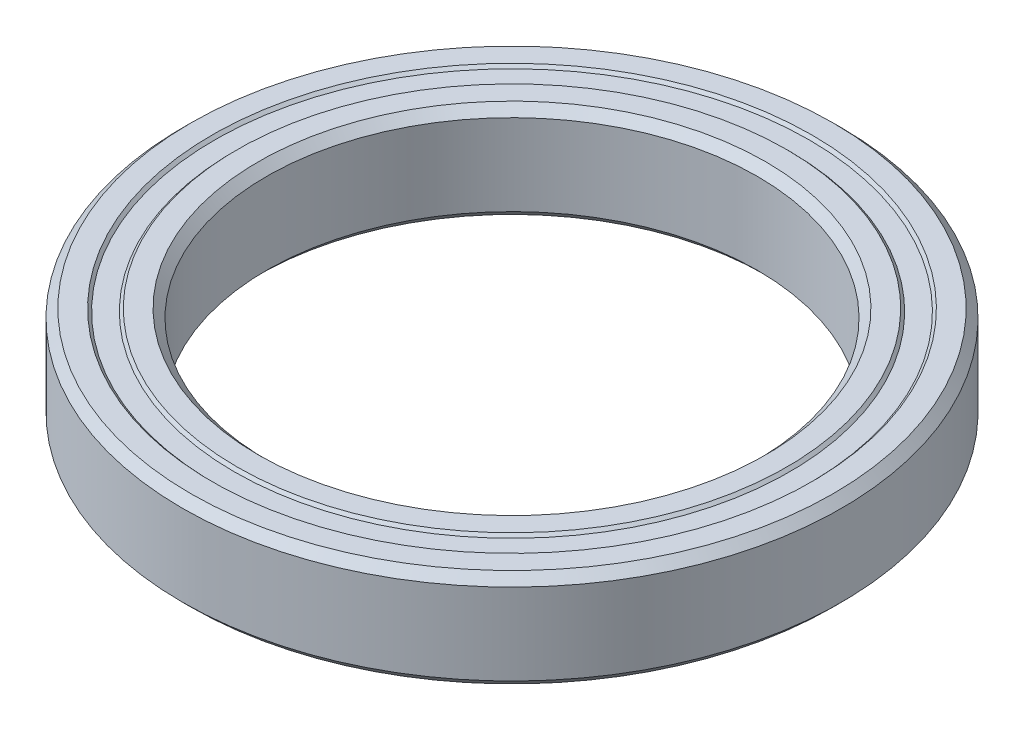
ISO-10303-21;
HEADER;
FILE_DESCRIPTION(('STEP AP214'),'2;1');
FILE_NAME('part.step','',(''),(''),'','','');
FILE_SCHEMA(('AUTOMOTIVE_DESIGN { 1 0 10303 214 1 1 1 1 }'));
ENDSEC;
DATA;
#1=APPLICATION_CONTEXT('core data for automotive mechanical design processes');
#2=APPLICATION_PROTOCOL_DEFINITION('international standard','automotive_design',2000,#1);
#3=PRODUCT_CONTEXT('',#1,'mechanical');
#4=PRODUCT('Part','Part','',(#3));
#5=PRODUCT_RELATED_PRODUCT_CATEGORY('part','',(#4));
#6=PRODUCT_DEFINITION_FORMATION('','',#4);
#7=PRODUCT_DEFINITION_CONTEXT('part definition',#1,'design');
#8=PRODUCT_DEFINITION('design','',#6,#7);
#9=PRODUCT_DEFINITION_SHAPE('','',#8);
#10=(LENGTH_UNIT() NAMED_UNIT(*) SI_UNIT(.MILLI.,.METRE.));
#11=(NAMED_UNIT(*) PLANE_ANGLE_UNIT() SI_UNIT($,.RADIAN.));
#12=(NAMED_UNIT(*) SI_UNIT($,.STERADIAN.) SOLID_ANGLE_UNIT());
#13=UNCERTAINTY_MEASURE_WITH_UNIT(LENGTH_MEASURE(1.E-05),#10,'distance_accuracy_value','');
#14=(GEOMETRIC_REPRESENTATION_CONTEXT(3) GLOBAL_UNCERTAINTY_ASSIGNED_CONTEXT((#13)) GLOBAL_UNIT_ASSIGNED_CONTEXT((#10,
#11,#12)) REPRESENTATION_CONTEXT('',''));
#15=CARTESIAN_POINT('',(0.,0.,0.));
#16=DIRECTION('',(0.,0.,1.));
#17=DIRECTION('',(1.,0.,0.));
#18=AXIS2_PLACEMENT_3D('',#15,#16,#17);
#19=CARTESIAN_POINT('',(0.,3.49999999999999,0.));
#20=DIRECTION('',(0.,1.,0.));
#21=DIRECTION('',(0.,0.,1.));
#22=AXIS2_PLACEMENT_3D('',#19,#20,#21);
#23=CONICAL_SURFACE('',#22,18.1,0.785398163397469);
#24=CARTESIAN_POINT('',(0.,2.90000000000002,0.));
#25=DIRECTION('',(0.,-1.,0.));
#26=DIRECTION('',(0.,0.,-1.));
#27=AXIS2_PLACEMENT_3D('',#24,#25,#26);
#28=CIRCLE('',#27,17.5);
#29=CARTESIAN_POINT('',(0.,2.90000000000002,-17.5));
#30=VERTEX_POINT('',#29);
#31=EDGE_CURVE('E10',#30,#30,#28,.T.);
#32=ORIENTED_EDGE('',*,*,#31,.T.);
#33=EDGE_LOOP('',(#32));
#34=FACE_BOUND('',#33,.T.);
#35=CARTESIAN_POINT('',(0.,3.49999999999999,0.));
#36=DIRECTION('',(0.,-1.,0.));
#37=DIRECTION('',(0.,0.,-1.));
#38=AXIS2_PLACEMENT_3D('',#35,#36,#37);
#39=CIRCLE('',#38,18.1);
#40=CARTESIAN_POINT('',(0.,3.49999999999999,-18.1));
#41=VERTEX_POINT('',#40);
#42=EDGE_CURVE('E88',#41,#41,#39,.T.);
#43=ORIENTED_EDGE('',*,*,#42,.F.);
#44=EDGE_LOOP('',(#43));
#45=FACE_BOUND('',#44,.T.);
#46=ADVANCED_FACE('F36',(#34,#45),#23,.F.);
#47=CARTESIAN_POINT('',(0.,-1.34942197217015,0.));
#48=DIRECTION('',(0.,-1.,0.));
#49=DIRECTION('',(0.,0.,-1.));
#50=AXIS2_PLACEMENT_3D('',#47,#48,#49);
#51=CYLINDRICAL_SURFACE('',#50,17.5);
#52=CARTESIAN_POINT('',(0.,-2.90000000000002,0.));
#53=DIRECTION('',(0.,-1.,0.));
#54=DIRECTION('',(0.,0.,-1.));
#55=AXIS2_PLACEMENT_3D('',#52,#53,#54);
#56=CIRCLE('',#55,17.5);
#57=CARTESIAN_POINT('',(0.,-2.90000000000002,-17.5));
#58=VERTEX_POINT('',#57);
#59=EDGE_CURVE('E42',#58,#58,#56,.T.);
#60=ORIENTED_EDGE('',*,*,#59,.T.);
#61=EDGE_LOOP('',(#60));
#62=FACE_BOUND('',#61,.T.);
#63=ORIENTED_EDGE('',*,*,#31,.F.);
#64=EDGE_LOOP('',(#63));
#65=FACE_BOUND('',#64,.T.);
#66=ADVANCED_FACE('F96',(#62,#65),#51,.F.);
#67=CARTESIAN_POINT('',(0.,-2.90000000000002,0.));
#68=DIRECTION('',(0.,-1.,0.));
#69=DIRECTION('',(0.,0.,-1.));
#70=AXIS2_PLACEMENT_3D('',#67,#68,#69);
#71=CONICAL_SURFACE('',#70,17.5,0.785398163397434);
#72=CARTESIAN_POINT('',(0.,-3.50000000000001,0.));
#73=DIRECTION('',(0.,-1.,0.));
#74=DIRECTION('',(0.,0.,-1.));
#75=AXIS2_PLACEMENT_3D('',#72,#73,#74);
#76=CIRCLE('',#75,18.1);
#77=CARTESIAN_POINT('',(0.,-3.50000000000001,-18.1));
#78=VERTEX_POINT('',#77);
#79=EDGE_CURVE('E46',#78,#78,#76,.T.);
#80=ORIENTED_EDGE('',*,*,#79,.T.);
#81=EDGE_LOOP('',(#80));
#82=FACE_BOUND('',#81,.T.);
#83=ORIENTED_EDGE('',*,*,#59,.F.);
#84=EDGE_LOOP('',(#83));
#85=FACE_BOUND('',#84,.T.);
#86=ADVANCED_FACE('F100',(#82,#85),#71,.F.);
#87=CARTESIAN_POINT('',(18.1,-3.50000000000001,0.));
#88=DIRECTION('',(0.,-1.,0.));
#89=DIRECTION('',(0.,0.,-1.));
#90=AXIS2_PLACEMENT_3D('',#87,#88,#89);
#91=PLANE('',#90);
#92=CARTESIAN_POINT('',(0.,-3.50000000000001,0.));
#93=DIRECTION('',(0.,-1.,0.));
#94=DIRECTION('',(0.,0.,-1.));
#95=AXIS2_PLACEMENT_3D('',#92,#93,#94);
#96=CIRCLE('',#95,19.6);
#97=CARTESIAN_POINT('',(0.,-3.50000000000001,-19.6));
#98=VERTEX_POINT('',#97);
#99=EDGE_CURVE('E50',#98,#98,#96,.T.);
#100=ORIENTED_EDGE('',*,*,#99,.T.);
#101=EDGE_LOOP('',(#100));
#102=FACE_BOUND('',#101,.T.);
#103=ORIENTED_EDGE('',*,*,#79,.F.);
#104=EDGE_LOOP('',(#103));
#105=FACE_BOUND('',#104,.T.);
#106=ADVANCED_FACE('F104',(#102,#105),#91,.T.);
#107=CARTESIAN_POINT('',(0.,-3.50000000000001,0.));
#108=DIRECTION('',(0.,1.,0.));
#109=DIRECTION('',(0.,0.,1.));
#110=AXIS2_PLACEMENT_3D('',#107,#108,#109);
#111=CONICAL_SURFACE('',#110,19.6,0.785398163397404);
#112=CARTESIAN_POINT('',(0.,-3.3,0.));
#113=DIRECTION('',(0.,-1.,0.));
#114=DIRECTION('',(0.,0.,-1.));
#115=AXIS2_PLACEMENT_3D('',#112,#113,#114);
#116=CIRCLE('',#115,19.8);
#117=CARTESIAN_POINT('',(0.,-3.3,-19.8));
#118=VERTEX_POINT('',#117);
#119=EDGE_CURVE('E55',#118,#118,#116,.T.);
#120=ORIENTED_EDGE('',*,*,#119,.T.);
#121=EDGE_LOOP('',(#120));
#122=FACE_BOUND('',#121,.T.);
#123=ORIENTED_EDGE('',*,*,#99,.F.);
#124=EDGE_LOOP('',(#123));
#125=FACE_BOUND('',#124,.T.);
#126=ADVANCED_FACE('F111',(#122,#125),#111,.T.);
#127=CARTESIAN_POINT('',(19.8,-3.3,0.));
#128=DIRECTION('',(0.,-1.,0.));
#129=DIRECTION('',(0.,0.,-1.));
#130=AXIS2_PLACEMENT_3D('',#127,#128,#129);
#131=PLANE('',#130);
#132=CARTESIAN_POINT('',(0.,-3.3,0.));
#133=DIRECTION('',(0.,-1.,0.));
#134=DIRECTION('',(0.,0.,-1.));
#135=AXIS2_PLACEMENT_3D('',#132,#133,#134);
#136=CIRCLE('',#135,21.2);
#137=CARTESIAN_POINT('',(0.,-3.3,-21.2));
#138=VERTEX_POINT('',#137);
#139=EDGE_CURVE('E58',#138,#138,#136,.T.);
#140=ORIENTED_EDGE('',*,*,#139,.T.);
#141=EDGE_LOOP('',(#140));
#142=FACE_BOUND('',#141,.T.);
#143=ORIENTED_EDGE('',*,*,#119,.F.);
#144=EDGE_LOOP('',(#143));
#145=FACE_BOUND('',#144,.T.);
#146=ADVANCED_FACE('F115',(#142,#145),#131,.T.);
#147=CARTESIAN_POINT('',(0.,-3.3,0.));
#148=DIRECTION('',(0.,-1.,0.));
#149=DIRECTION('',(0.,0.,-1.));
#150=AXIS2_PLACEMENT_3D('',#147,#148,#149);
#151=CONICAL_SURFACE('',#150,21.2,0.785398163397396);
#152=CARTESIAN_POINT('',(0.,-3.50000000000001,0.));
#153=DIRECTION('',(0.,-1.,0.));
#154=DIRECTION('',(0.,0.,-1.));
#155=AXIS2_PLACEMENT_3D('',#152,#153,#154);
#156=CIRCLE('',#155,21.4);
#157=CARTESIAN_POINT('',(0.,-3.50000000000001,-21.4));
#158=VERTEX_POINT('',#157);
#159=EDGE_CURVE('E61',#158,#158,#156,.T.);
#160=ORIENTED_EDGE('',*,*,#159,.T.);
#161=EDGE_LOOP('',(#160));
#162=FACE_BOUND('',#161,.T.);
#163=ORIENTED_EDGE('',*,*,#139,.F.);
#164=EDGE_LOOP('',(#163));
#165=FACE_BOUND('',#164,.T.);
#166=ADVANCED_FACE('F119',(#162,#165),#151,.F.);
#167=CARTESIAN_POINT('',(21.4,-3.50000000000001,0.));
#168=DIRECTION('',(0.,-1.,0.));
#169=DIRECTION('',(0.,0.,-1.));
#170=AXIS2_PLACEMENT_3D('',#167,#168,#169);
#171=PLANE('',#170);
#172=CARTESIAN_POINT('',(0.,-3.50000000000001,0.));
#173=DIRECTION('',(0.,-1.,0.));
#174=DIRECTION('',(0.,0.,-1.));
#175=AXIS2_PLACEMENT_3D('',#172,#173,#174);
#176=CIRCLE('',#175,22.9);
#177=CARTESIAN_POINT('',(0.,-3.50000000000001,-22.9));
#178=VERTEX_POINT('',#177);
#179=EDGE_CURVE('E64',#178,#178,#176,.T.);
#180=ORIENTED_EDGE('',*,*,#179,.T.);
#181=EDGE_LOOP('',(#180));
#182=FACE_BOUND('',#181,.T.);
#183=ORIENTED_EDGE('',*,*,#159,.F.);
#184=EDGE_LOOP('',(#183));
#185=FACE_BOUND('',#184,.T.);
#186=ADVANCED_FACE('F123',(#182,#185),#171,.T.);
#187=CARTESIAN_POINT('',(0.,-3.50000000000001,0.));
#188=DIRECTION('',(0.,1.,0.));
#189=DIRECTION('',(0.,0.,1.));
#190=AXIS2_PLACEMENT_3D('',#187,#188,#189);
#191=CONICAL_SURFACE('',#190,22.9,0.785398163397445);
#192=CARTESIAN_POINT('',(0.,-2.90000000000002,0.));
#193=DIRECTION('',(0.,-1.,0.));
#194=DIRECTION('',(0.,0.,-1.));
#195=AXIS2_PLACEMENT_3D('',#192,#193,#194);
#196=CIRCLE('',#195,23.5);
#197=CARTESIAN_POINT('',(0.,-2.90000000000002,-23.5));
#198=VERTEX_POINT('',#197);
#199=EDGE_CURVE('E67',#198,#198,#196,.T.);
#200=ORIENTED_EDGE('',*,*,#199,.T.);
#201=EDGE_LOOP('',(#200));
#202=FACE_BOUND('',#201,.T.);
#203=ORIENTED_EDGE('',*,*,#179,.F.);
#204=EDGE_LOOP('',(#203));
#205=FACE_BOUND('',#204,.T.);
#206=ADVANCED_FACE('F127',(#202,#205),#191,.T.);
#207=CARTESIAN_POINT('',(0.,-1.34942197217015,0.));
#208=DIRECTION('',(0.,-1.,0.));
#209=DIRECTION('',(0.,0.,-1.));
#210=AXIS2_PLACEMENT_3D('',#207,#208,#209);
#211=CYLINDRICAL_SURFACE('',#210,23.5);
#212=CARTESIAN_POINT('',(0.,2.90000000000001,0.));
#213=DIRECTION('',(0.,-1.,0.));
#214=DIRECTION('',(0.,0.,-1.));
#215=AXIS2_PLACEMENT_3D('',#212,#213,#214);
#216=CIRCLE('',#215,23.5);
#217=CARTESIAN_POINT('',(0.,2.90000000000001,-23.5));
#218=VERTEX_POINT('',#217);
#219=EDGE_CURVE('E70',#218,#218,#216,.T.);
#220=ORIENTED_EDGE('',*,*,#219,.T.);
#221=EDGE_LOOP('',(#220));
#222=FACE_BOUND('',#221,.T.);
#223=ORIENTED_EDGE('',*,*,#199,.F.);
#224=EDGE_LOOP('',(#223));
#225=FACE_BOUND('',#224,.T.);
#226=ADVANCED_FACE('F131',(#222,#225),#211,.T.);
#227=CARTESIAN_POINT('',(0.,2.90000000000001,0.));
#228=DIRECTION('',(0.,-1.,0.));
#229=DIRECTION('',(0.,0.,-1.));
#230=AXIS2_PLACEMENT_3D('',#227,#228,#229);
#231=CONICAL_SURFACE('',#230,23.5,0.785398163397445);
#232=CARTESIAN_POINT('',(0.,3.49999999999999,0.));
#233=DIRECTION('',(0.,-1.,0.));
#234=DIRECTION('',(0.,0.,-1.));
#235=AXIS2_PLACEMENT_3D('',#232,#233,#234);
#236=CIRCLE('',#235,22.9);
#237=CARTESIAN_POINT('',(0.,3.49999999999999,-22.9));
#238=VERTEX_POINT('',#237);
#239=EDGE_CURVE('E73',#238,#238,#236,.T.);
#240=ORIENTED_EDGE('',*,*,#239,.T.);
#241=EDGE_LOOP('',(#240));
#242=FACE_BOUND('',#241,.T.);
#243=ORIENTED_EDGE('',*,*,#219,.F.);
#244=EDGE_LOOP('',(#243));
#245=FACE_BOUND('',#244,.T.);
#246=ADVANCED_FACE('F135',(#242,#245),#231,.T.);
#247=CARTESIAN_POINT('',(22.9,3.49999999999999,0.));
#248=DIRECTION('',(0.,1.,0.));
#249=DIRECTION('',(0.,0.,1.));
#250=AXIS2_PLACEMENT_3D('',#247,#248,#249);
#251=PLANE('',#250);
#252=CARTESIAN_POINT('',(0.,3.49999999999999,0.));
#253=DIRECTION('',(0.,-1.,0.));
#254=DIRECTION('',(0.,0.,-1.));
#255=AXIS2_PLACEMENT_3D('',#252,#253,#254);
#256=CIRCLE('',#255,21.4);
#257=CARTESIAN_POINT('',(0.,3.49999999999999,-21.4));
#258=VERTEX_POINT('',#257);
#259=EDGE_CURVE('E76',#258,#258,#256,.T.);
#260=ORIENTED_EDGE('',*,*,#259,.T.);
#261=EDGE_LOOP('',(#260));
#262=FACE_BOUND('',#261,.T.);
#263=ORIENTED_EDGE('',*,*,#239,.F.);
#264=EDGE_LOOP('',(#263));
#265=FACE_BOUND('',#264,.T.);
#266=ADVANCED_FACE('F139',(#262,#265),#251,.T.);
#267=CARTESIAN_POINT('',(0.,3.49999999999999,0.));
#268=DIRECTION('',(0.,1.,0.));
#269=DIRECTION('',(0.,0.,1.));
#270=AXIS2_PLACEMENT_3D('',#267,#268,#269);
#271=CONICAL_SURFACE('',#270,21.4,0.785398163397448);
#272=CARTESIAN_POINT('',(0.,3.29999999999999,0.));
#273=DIRECTION('',(0.,-1.,0.));
#274=DIRECTION('',(0.,0.,-1.));
#275=AXIS2_PLACEMENT_3D('',#272,#273,#274);
#276=CIRCLE('',#275,21.2);
#277=CARTESIAN_POINT('',(0.,3.29999999999999,-21.2));
#278=VERTEX_POINT('',#277);
#279=EDGE_CURVE('E79',#278,#278,#276,.T.);
#280=ORIENTED_EDGE('',*,*,#279,.T.);
#281=EDGE_LOOP('',(#280));
#282=FACE_BOUND('',#281,.T.);
#283=ORIENTED_EDGE('',*,*,#259,.F.);
#284=EDGE_LOOP('',(#283));
#285=FACE_BOUND('',#284,.T.);
#286=ADVANCED_FACE('F143',(#282,#285),#271,.F.);
#287=CARTESIAN_POINT('',(21.2,3.3,0.));
#288=DIRECTION('',(0.,1.,0.));
#289=DIRECTION('',(0.,0.,1.));
#290=AXIS2_PLACEMENT_3D('',#287,#288,#289);
#291=PLANE('',#290);
#292=CARTESIAN_POINT('',(0.,3.3,0.));
#293=DIRECTION('',(0.,-1.,0.));
#294=DIRECTION('',(0.,0.,-1.));
#295=AXIS2_PLACEMENT_3D('',#292,#293,#294);
#296=CIRCLE('',#295,19.8);
#297=CARTESIAN_POINT('',(0.,3.3,-19.8));
#298=VERTEX_POINT('',#297);
#299=EDGE_CURVE('E82',#298,#298,#296,.T.);
#300=ORIENTED_EDGE('',*,*,#299,.T.);
#301=EDGE_LOOP('',(#300));
#302=FACE_BOUND('',#301,.T.);
#303=ORIENTED_EDGE('',*,*,#279,.F.);
#304=EDGE_LOOP('',(#303));
#305=FACE_BOUND('',#304,.T.);
#306=ADVANCED_FACE('F147',(#302,#305),#291,.T.);
#307=CARTESIAN_POINT('',(0.,3.3,0.));
#308=DIRECTION('',(0.,-1.,0.));
#309=DIRECTION('',(0.,0.,-1.));
#310=AXIS2_PLACEMENT_3D('',#307,#308,#309);
#311=CONICAL_SURFACE('',#310,19.8,0.785398163397461);
#312=CARTESIAN_POINT('',(0.,3.49999999999999,0.));
#313=DIRECTION('',(0.,-1.,0.));
#314=DIRECTION('',(0.,0.,-1.));
#315=AXIS2_PLACEMENT_3D('',#312,#313,#314);
#316=CIRCLE('',#315,19.6);
#317=CARTESIAN_POINT('',(0.,3.49999999999999,-19.6));
#318=VERTEX_POINT('',#317);
#319=EDGE_CURVE('E85',#318,#318,#316,.T.);
#320=ORIENTED_EDGE('',*,*,#319,.T.);
#321=EDGE_LOOP('',(#320));
#322=FACE_BOUND('',#321,.T.);
#323=ORIENTED_EDGE('',*,*,#299,.F.);
#324=EDGE_LOOP('',(#323));
#325=FACE_BOUND('',#324,.T.);
#326=ADVANCED_FACE('F151',(#322,#325),#311,.T.);
#327=CARTESIAN_POINT('',(19.6,3.49999999999999,0.));
#328=DIRECTION('',(0.,1.,0.));
#329=DIRECTION('',(0.,0.,1.));
#330=AXIS2_PLACEMENT_3D('',#327,#328,#329);
#331=PLANE('',#330);
#332=ORIENTED_EDGE('',*,*,#42,.T.);
#333=EDGE_LOOP('',(#332));
#334=FACE_BOUND('',#333,.T.);
#335=ORIENTED_EDGE('',*,*,#319,.F.);
#336=EDGE_LOOP('',(#335));
#337=FACE_BOUND('',#336,.T.);
#338=ADVANCED_FACE('F92',(#334,#337),#331,.T.);
#339=CLOSED_SHELL('',(#46,#66,#86,#106,#126,#146,#166,#186,#206,#226,#246,#266,#286,#306,#326,#338));
#340=MANIFOLD_SOLID_BREP('B2',#339);
#341=ADVANCED_BREP_SHAPE_REPRESENTATION('',(#18,#340),#14);
#342=SHAPE_DEFINITION_REPRESENTATION(#9,#341);
ENDSEC;
END-ISO-10303-21;
